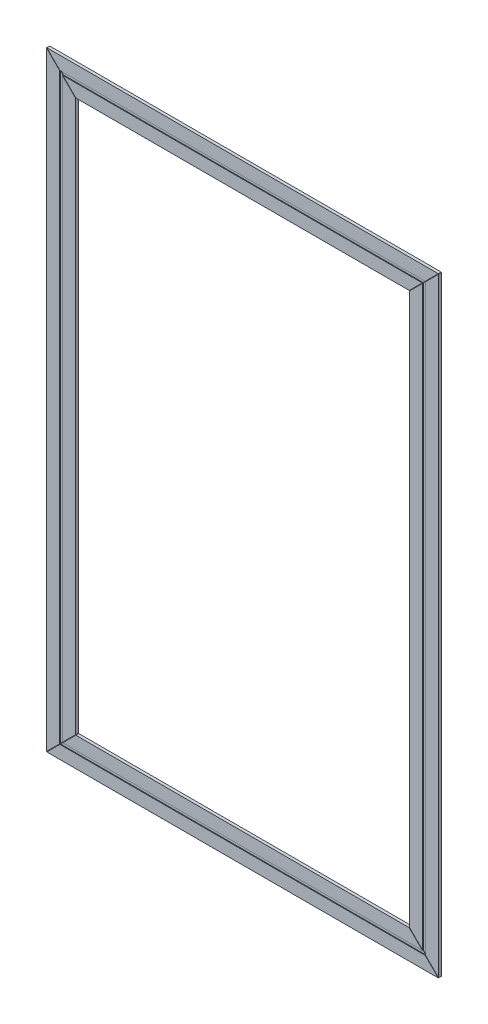
ISO-10303-21;
HEADER;
FILE_DESCRIPTION(('STEP AP214'),'2;1');
FILE_NAME('part.step','',(''),(''),'','','');
FILE_SCHEMA(('AUTOMOTIVE_DESIGN { 1 0 10303 214 1 1 1 1 }'));
ENDSEC;
DATA;
#1=APPLICATION_CONTEXT('core data for automotive mechanical design processes');
#2=APPLICATION_PROTOCOL_DEFINITION('international standard','automotive_design',2000,#1);
#3=PRODUCT_CONTEXT('',#1,'mechanical');
#4=PRODUCT('Part','Part','',(#3));
#5=PRODUCT_RELATED_PRODUCT_CATEGORY('part','',(#4));
#6=PRODUCT_DEFINITION_FORMATION('','',#4);
#7=PRODUCT_DEFINITION_CONTEXT('part definition',#1,'design');
#8=PRODUCT_DEFINITION('design','',#6,#7);
#9=PRODUCT_DEFINITION_SHAPE('','',#8);
#10=(LENGTH_UNIT() NAMED_UNIT(*) SI_UNIT(.MILLI.,.METRE.));
#11=(NAMED_UNIT(*) PLANE_ANGLE_UNIT() SI_UNIT($,.RADIAN.));
#12=(NAMED_UNIT(*) SI_UNIT($,.STERADIAN.) SOLID_ANGLE_UNIT());
#13=UNCERTAINTY_MEASURE_WITH_UNIT(LENGTH_MEASURE(1.E-05),#10,'distance_accuracy_value','');
#14=(GEOMETRIC_REPRESENTATION_CONTEXT(3) GLOBAL_UNCERTAINTY_ASSIGNED_CONTEXT((#13)) GLOBAL_UNIT_ASSIGNED_CONTEXT((#10,
#11,#12)) REPRESENTATION_CONTEXT('',''));
#15=CARTESIAN_POINT('',(0.,0.,0.));
#16=DIRECTION('',(0.,0.,1.));
#17=DIRECTION('',(1.,0.,0.));
#18=AXIS2_PLACEMENT_3D('',#15,#16,#17);
#19=CARTESIAN_POINT('',(0.,0.,2.));
#20=DIRECTION('',(0.,0.,1.));
#21=DIRECTION('',(1.,0.,0.));
#22=AXIS2_PLACEMENT_3D('',#19,#20,#21);
#23=PLANE('',#22);
#24=DIRECTION('',(0.70710678118655,0.707106781186545,0.));
#25=VECTOR('',#24,1.);
#26=CARTESIAN_POINT('',(-134.8,-210.,2.));
#27=LINE('',#26,#25);
#28=CARTESIAN_POINT('',(-134.8,-210.,2.));
#29=VERTEX_POINT('',#28);
#30=CARTESIAN_POINT('',(-125.8,-201.,2.));
#31=VERTEX_POINT('',#30);
#32=EDGE_CURVE('E124',#29,#31,#27,.T.);
#33=ORIENTED_EDGE('',*,*,#32,.F.);
#34=DIRECTION('',(1.,0.,0.));
#35=VECTOR('',#34,1.);
#36=CARTESIAN_POINT('',(0.,-210.,2.));
#37=LINE('',#36,#35);
#38=CARTESIAN_POINT('',(134.8,-210.,2.));
#39=VERTEX_POINT('',#38);
#40=EDGE_CURVE('E136',#29,#39,#37,.T.);
#41=ORIENTED_EDGE('',*,*,#40,.T.);
#42=DIRECTION('',(0.70710678118655,-0.707106781186545,0.));
#43=VECTOR('',#42,1.);
#44=CARTESIAN_POINT('',(134.8,-210.,2.));
#45=LINE('',#44,#43);
#46=CARTESIAN_POINT('',(125.8,-201.,2.));
#47=VERTEX_POINT('',#46);
#48=EDGE_CURVE('E130',#47,#39,#45,.T.);
#49=ORIENTED_EDGE('',*,*,#48,.F.);
#50=DIRECTION('',(-1.,0.,0.));
#51=VECTOR('',#50,1.);
#52=CARTESIAN_POINT('',(0.,-201.,2.));
#53=LINE('',#52,#51);
#54=EDGE_CURVE('E138',#47,#31,#53,.T.);
#55=ORIENTED_EDGE('',*,*,#54,.T.);
#56=EDGE_LOOP('',(#33,#41,#49,#55));
#57=FACE_BOUND('',#56,.T.);
#58=ADVANCED_FACE('F70',(#57),#23,.T.);
#59=CARTESIAN_POINT('',(0.,0.,0.));
#60=DIRECTION('',(0.,0.,1.));
#61=DIRECTION('',(1.,0.,0.));
#62=AXIS2_PLACEMENT_3D('',#59,#60,#61);
#63=PLANE('',#62);
#64=DIRECTION('',(1.,0.,0.));
#65=VECTOR('',#64,1.);
#66=CARTESIAN_POINT('',(0.,-210.,0.));
#67=LINE('',#66,#65);
#68=CARTESIAN_POINT('',(-134.8,-210.,0.));
#69=VERTEX_POINT('',#68);
#70=CARTESIAN_POINT('',(134.8,-210.,0.));
#71=VERTEX_POINT('',#70);
#72=EDGE_CURVE('E151',#69,#71,#67,.T.);
#73=ORIENTED_EDGE('',*,*,#72,.F.);
#74=DIRECTION('',(0.70710678118655,0.707106781186545,0.));
#75=VECTOR('',#74,1.);
#76=CARTESIAN_POINT('',(37.6000000000005,-37.6000000000008,0.));
#77=LINE('',#76,#75);
#78=CARTESIAN_POINT('',(-114.8,-190.,0.));
#79=VERTEX_POINT('',#78);
#80=EDGE_CURVE('E89',#69,#79,#77,.T.);
#81=ORIENTED_EDGE('',*,*,#80,.T.);
#82=DIRECTION('',(1.,0.,0.));
#83=VECTOR('',#82,1.);
#84=CARTESIAN_POINT('',(0.,-190.,0.));
#85=LINE('',#84,#83);
#86=CARTESIAN_POINT('',(114.8,-190.,0.));
#87=VERTEX_POINT('',#86);
#88=EDGE_CURVE('E157',#79,#87,#85,.T.);
#89=ORIENTED_EDGE('',*,*,#88,.T.);
#90=DIRECTION('',(0.70710678118655,-0.707106781186545,0.));
#91=VECTOR('',#90,1.);
#92=CARTESIAN_POINT('',(-37.6000000000005,-37.6000000000008,0.));
#93=LINE('',#92,#91);
#94=EDGE_CURVE('E152',#87,#71,#93,.T.);
#95=ORIENTED_EDGE('',*,*,#94,.T.);
#96=EDGE_LOOP('',(#73,#81,#89,#95));
#97=FACE_BOUND('',#96,.T.);
#98=ADVANCED_FACE('F72',(#97),#63,.F.);
#99=CARTESIAN_POINT('',(0.,0.,1.5));
#100=DIRECTION('',(0.,0.,1.));
#101=DIRECTION('',(1.,0.,0.));
#102=AXIS2_PLACEMENT_3D('',#99,#100,#101);
#103=PLANE('',#102);
#104=DIRECTION('',(0.70710678118655,0.707106781186545,0.));
#105=VECTOR('',#104,1.);
#106=CARTESIAN_POINT('',(37.6000000000005,-37.6000000000008,1.5));
#107=LINE('',#106,#105);
#108=CARTESIAN_POINT('',(-125.8,-201.,1.5));
#109=VERTEX_POINT('',#108);
#110=CARTESIAN_POINT('',(-123.8,-199.,1.5));
#111=VERTEX_POINT('',#110);
#112=EDGE_CURVE('E139',#109,#111,#107,.T.);
#113=ORIENTED_EDGE('',*,*,#112,.F.);
#114=DIRECTION('',(-1.,0.,0.));
#115=VECTOR('',#114,1.);
#116=CARTESIAN_POINT('',(0.,-201.,1.5));
#117=LINE('',#116,#115);
#118=CARTESIAN_POINT('',(125.8,-201.,1.5));
#119=VERTEX_POINT('',#118);
#120=EDGE_CURVE('E153',#119,#109,#117,.T.);
#121=ORIENTED_EDGE('',*,*,#120,.F.);
#122=DIRECTION('',(0.70710678118655,-0.707106781186545,0.));
#123=VECTOR('',#122,1.);
#124=CARTESIAN_POINT('',(-37.6000000000005,-37.6000000000008,1.5));
#125=LINE('',#124,#123);
#126=CARTESIAN_POINT('',(123.8,-199.,1.5));
#127=VERTEX_POINT('',#126);
#128=EDGE_CURVE('E179',#127,#119,#125,.T.);
#129=ORIENTED_EDGE('',*,*,#128,.F.);
#130=DIRECTION('',(-1.,0.,0.));
#131=VECTOR('',#130,1.);
#132=CARTESIAN_POINT('',(0.,-199.,1.5));
#133=LINE('',#132,#131);
#134=EDGE_CURVE('E148',#127,#111,#133,.T.);
#135=ORIENTED_EDGE('',*,*,#134,.T.);
#136=EDGE_LOOP('',(#113,#121,#129,#135));
#137=FACE_BOUND('',#136,.T.);
#138=ADVANCED_FACE('F210',(#137),#103,.T.);
#139=CARTESIAN_POINT('',(0.,0.,2.));
#140=DIRECTION('',(0.,0.,1.));
#141=DIRECTION('',(1.,0.,0.));
#142=AXIS2_PLACEMENT_3D('',#139,#140,#141);
#143=PLANE('',#142);
#144=DIRECTION('',(0.70710678118655,0.707106781186545,0.));
#145=VECTOR('',#144,1.);
#146=CARTESIAN_POINT('',(37.6000000000005,-37.6000000000008,2.));
#147=LINE('',#146,#145);
#148=CARTESIAN_POINT('',(-123.8,-199.,2.));
#149=VERTEX_POINT('',#148);
#150=CARTESIAN_POINT('',(-114.8,-190.,2.));
#151=VERTEX_POINT('',#150);
#152=EDGE_CURVE('E13',#149,#151,#147,.T.);
#153=ORIENTED_EDGE('',*,*,#152,.F.);
#154=DIRECTION('',(-1.,0.,0.));
#155=VECTOR('',#154,1.);
#156=CARTESIAN_POINT('',(0.,-199.,2.));
#157=LINE('',#156,#155);
#158=CARTESIAN_POINT('',(123.8,-199.,2.));
#159=VERTEX_POINT('',#158);
#160=EDGE_CURVE('E165',#159,#149,#157,.T.);
#161=ORIENTED_EDGE('',*,*,#160,.F.);
#162=CARTESIAN_POINT('',(114.8,-190.,2.));
#163=VERTEX_POINT('',#162);
#164=EDGE_CURVE('E74',#163,#159,#45,.T.);
#165=ORIENTED_EDGE('',*,*,#164,.F.);
#166=DIRECTION('',(1.,0.,0.));
#167=VECTOR('',#166,1.);
#168=CARTESIAN_POINT('',(0.,-190.,2.));
#169=LINE('',#168,#167);
#170=EDGE_CURVE('E160',#151,#163,#169,.T.);
#171=ORIENTED_EDGE('',*,*,#170,.F.);
#172=EDGE_LOOP('',(#153,#161,#165,#171));
#173=FACE_BOUND('',#172,.T.);
#174=ADVANCED_FACE('F199',(#173),#143,.T.);
#175=CARTESIAN_POINT('',(0.,-210.,2.));
#176=DIRECTION('',(0.,1.,0.));
#177=DIRECTION('',(0.,0.,1.));
#178=AXIS2_PLACEMENT_3D('',#175,#176,#177);
#179=PLANE('',#178);
#180=ORIENTED_EDGE('',*,*,#40,.F.);
#181=DIRECTION('',(0.,0.,1.));
#182=VECTOR('',#181,1.);
#183=CARTESIAN_POINT('',(-134.8,-210.,-19.));
#184=LINE('',#183,#182);
#185=EDGE_CURVE('E120',#69,#29,#184,.T.);
#186=ORIENTED_EDGE('',*,*,#185,.F.);
#187=ORIENTED_EDGE('',*,*,#72,.T.);
#188=DIRECTION('',(0.,0.,1.));
#189=VECTOR('',#188,1.);
#190=CARTESIAN_POINT('',(134.8,-210.,-19.));
#191=LINE('',#190,#189);
#192=EDGE_CURVE('E143',#71,#39,#191,.T.);
#193=ORIENTED_EDGE('',*,*,#192,.T.);
#194=EDGE_LOOP('',(#180,#186,#187,#193));
#195=FACE_BOUND('',#194,.T.);
#196=ADVANCED_FACE('F142',(#195),#179,.F.);
#197=CARTESIAN_POINT('',(0.,-201.,2.));
#198=DIRECTION('',(0.,-1.,0.));
#199=DIRECTION('',(0.,0.,-1.));
#200=AXIS2_PLACEMENT_3D('',#197,#198,#199);
#201=PLANE('',#200);
#202=ORIENTED_EDGE('',*,*,#120,.T.);
#203=DIRECTION('',(0.,0.,1.));
#204=VECTOR('',#203,1.);
#205=CARTESIAN_POINT('',(-125.8,-201.,2.));
#206=LINE('',#205,#204);
#207=EDGE_CURVE('E156',#109,#31,#206,.T.);
#208=ORIENTED_EDGE('',*,*,#207,.T.);
#209=ORIENTED_EDGE('',*,*,#54,.F.);
#210=DIRECTION('',(0.,0.,-1.));
#211=VECTOR('',#210,1.);
#212=CARTESIAN_POINT('',(125.8,-201.,2.));
#213=LINE('',#212,#211);
#214=EDGE_CURVE('E168',#47,#119,#213,.T.);
#215=ORIENTED_EDGE('',*,*,#214,.T.);
#216=EDGE_LOOP('',(#202,#208,#209,#215));
#217=FACE_BOUND('',#216,.T.);
#218=ADVANCED_FACE('F203',(#217),#201,.F.);
#219=CARTESIAN_POINT('',(0.,-199.,2.));
#220=DIRECTION('',(0.,-1.,0.));
#221=DIRECTION('',(0.,0.,-1.));
#222=AXIS2_PLACEMENT_3D('',#219,#220,#221);
#223=PLANE('',#222);
#224=DIRECTION('',(0.,0.,1.));
#225=VECTOR('',#224,1.);
#226=CARTESIAN_POINT('',(-123.8,-199.,2.));
#227=LINE('',#226,#225);
#228=EDGE_CURVE('E80',#111,#149,#227,.T.);
#229=ORIENTED_EDGE('',*,*,#228,.F.);
#230=ORIENTED_EDGE('',*,*,#134,.F.);
#231=DIRECTION('',(0.,0.,-1.));
#232=VECTOR('',#231,1.);
#233=CARTESIAN_POINT('',(123.8,-199.,2.));
#234=LINE('',#233,#232);
#235=EDGE_CURVE('E181',#159,#127,#234,.T.);
#236=ORIENTED_EDGE('',*,*,#235,.F.);
#237=ORIENTED_EDGE('',*,*,#160,.T.);
#238=EDGE_LOOP('',(#229,#230,#236,#237));
#239=FACE_BOUND('',#238,.T.);
#240=ADVANCED_FACE('F214',(#239),#223,.T.);
#241=CARTESIAN_POINT('',(0.,-190.,2.));
#242=DIRECTION('',(0.,1.,0.));
#243=DIRECTION('',(0.,0.,1.));
#244=AXIS2_PLACEMENT_3D('',#241,#242,#243);
#245=PLANE('',#244);
#246=DIRECTION('',(0.,0.,1.));
#247=VECTOR('',#246,1.);
#248=CARTESIAN_POINT('',(-114.8,-190.,-19.));
#249=LINE('',#248,#247);
#250=EDGE_CURVE('E164',#79,#151,#249,.T.);
#251=ORIENTED_EDGE('',*,*,#250,.T.);
#252=ORIENTED_EDGE('',*,*,#170,.T.);
#253=DIRECTION('',(0.,0.,1.));
#254=VECTOR('',#253,1.);
#255=CARTESIAN_POINT('',(114.8,-190.,-19.));
#256=LINE('',#255,#254);
#257=EDGE_CURVE('E163',#87,#163,#256,.T.);
#258=ORIENTED_EDGE('',*,*,#257,.F.);
#259=ORIENTED_EDGE('',*,*,#88,.F.);
#260=EDGE_LOOP('',(#251,#252,#258,#259));
#261=FACE_BOUND('',#260,.T.);
#262=ADVANCED_FACE('F194',(#261),#245,.T.);
#263=CARTESIAN_POINT('',(134.8,-210.,-19.));
#264=DIRECTION('',(-0.707106781186545,-0.70710678118655,0.));
#265=DIRECTION('',(0.70710678118655,-0.707106781186545,0.));
#266=AXIS2_PLACEMENT_3D('',#263,#264,#265);
#267=PLANE('',#266);
#268=ORIENTED_EDGE('',*,*,#257,.T.);
#269=ORIENTED_EDGE('',*,*,#164,.T.);
#270=ORIENTED_EDGE('',*,*,#235,.T.);
#271=ORIENTED_EDGE('',*,*,#128,.T.);
#272=ORIENTED_EDGE('',*,*,#214,.F.);
#273=ORIENTED_EDGE('',*,*,#48,.T.);
#274=ORIENTED_EDGE('',*,*,#192,.F.);
#275=ORIENTED_EDGE('',*,*,#94,.F.);
#276=EDGE_LOOP('',(#268,#269,#270,#271,#272,#273,#274,#275));
#277=FACE_BOUND('',#276,.T.);
#278=ADVANCED_FACE('F190',(#277),#267,.F.);
#279=CARTESIAN_POINT('',(-134.8,-210.,-19.));
#280=DIRECTION('',(0.707106781186545,-0.70710678118655,0.));
#281=DIRECTION('',(0.70710678118655,0.707106781186545,0.));
#282=AXIS2_PLACEMENT_3D('',#279,#280,#281);
#283=PLANE('',#282);
#284=ORIENTED_EDGE('',*,*,#185,.T.);
#285=ORIENTED_EDGE('',*,*,#32,.T.);
#286=ORIENTED_EDGE('',*,*,#207,.F.);
#287=ORIENTED_EDGE('',*,*,#112,.T.);
#288=ORIENTED_EDGE('',*,*,#228,.T.);
#289=ORIENTED_EDGE('',*,*,#152,.T.);
#290=ORIENTED_EDGE('',*,*,#250,.F.);
#291=ORIENTED_EDGE('',*,*,#80,.F.);
#292=EDGE_LOOP('',(#284,#285,#286,#287,#288,#289,#290,#291));
#293=FACE_BOUND('',#292,.T.);
#294=ADVANCED_FACE('F122',(#293),#283,.F.);
#295=CLOSED_SHELL('',(#58,#98,#138,#174,#196,#218,#240,#262,#278,#294));
#296=MANIFOLD_SOLID_BREP('B2',#295);
#297=CARTESIAN_POINT('',(0.,0.,2.));
#298=DIRECTION('',(0.,0.,1.));
#299=DIRECTION('',(1.,0.,0.));
#300=AXIS2_PLACEMENT_3D('',#297,#298,#299);
#301=PLANE('',#300);
#302=DIRECTION('',(-0.70710678118655,-0.707106781186545,0.));
#303=VECTOR('',#302,1.);
#304=CARTESIAN_POINT('',(134.8,210.,2.));
#305=LINE('',#304,#303);
#306=CARTESIAN_POINT('',(134.8,210.,2.));
#307=VERTEX_POINT('',#306);
#308=CARTESIAN_POINT('',(125.8,201.,2.));
#309=VERTEX_POINT('',#308);
#310=EDGE_CURVE('E394',#307,#309,#305,.T.);
#311=ORIENTED_EDGE('',*,*,#310,.F.);
#312=DIRECTION('',(1.,0.,0.));
#313=VECTOR('',#312,1.);
#314=CARTESIAN_POINT('',(0.,210.,2.));
#315=LINE('',#314,#313);
#316=CARTESIAN_POINT('',(-134.8,210.,2.));
#317=VERTEX_POINT('',#316);
#318=EDGE_CURVE('E511',#317,#307,#315,.T.);
#319=ORIENTED_EDGE('',*,*,#318,.F.);
#320=DIRECTION('',(-0.70710678118655,0.707106781186545,0.));
#321=VECTOR('',#320,1.);
#322=CARTESIAN_POINT('',(-134.8,210.,2.));
#323=LINE('',#322,#321);
#324=CARTESIAN_POINT('',(-125.8,201.,2.));
#325=VERTEX_POINT('',#324);
#326=EDGE_CURVE('E499',#325,#317,#323,.T.);
#327=ORIENTED_EDGE('',*,*,#326,.F.);
#328=DIRECTION('',(-1.,0.,0.));
#329=VECTOR('',#328,1.);
#330=CARTESIAN_POINT('',(0.,201.,2.));
#331=LINE('',#330,#329);
#332=EDGE_CURVE('E508',#309,#325,#331,.T.);
#333=ORIENTED_EDGE('',*,*,#332,.F.);
#334=EDGE_LOOP('',(#311,#319,#327,#333));
#335=FACE_BOUND('',#334,.T.);
#336=ADVANCED_FACE('F391',(#335),#301,.T.);
#337=CARTESIAN_POINT('',(0.,0.,2.));
#338=DIRECTION('',(0.,0.,1.));
#339=DIRECTION('',(1.,0.,0.));
#340=AXIS2_PLACEMENT_3D('',#337,#338,#339);
#341=PLANE('',#340);
#342=DIRECTION('',(-0.70710678118655,-0.707106781186545,0.));
#343=VECTOR('',#342,1.);
#344=CARTESIAN_POINT('',(-37.6000000000004,37.6000000000007,2.));
#345=LINE('',#344,#343);
#346=CARTESIAN_POINT('',(123.8,199.,2.));
#347=VERTEX_POINT('',#346);
#348=CARTESIAN_POINT('',(114.8,190.,2.));
#349=VERTEX_POINT('',#348);
#350=EDGE_CURVE('E68',#347,#349,#345,.T.);
#351=ORIENTED_EDGE('',*,*,#350,.F.);
#352=DIRECTION('',(-1.,0.,0.));
#353=VECTOR('',#352,1.);
#354=CARTESIAN_POINT('',(0.,199.,2.));
#355=LINE('',#354,#353);
#356=CARTESIAN_POINT('',(-123.8,199.,2.));
#357=VERTEX_POINT('',#356);
#358=EDGE_CURVE('E489',#347,#357,#355,.T.);
#359=ORIENTED_EDGE('',*,*,#358,.T.);
#360=CARTESIAN_POINT('',(-114.8,190.,2.));
#361=VERTEX_POINT('',#360);
#362=EDGE_CURVE('E502',#361,#357,#323,.T.);
#363=ORIENTED_EDGE('',*,*,#362,.F.);
#364=DIRECTION('',(1.,0.,0.));
#365=VECTOR('',#364,1.);
#366=CARTESIAN_POINT('',(0.,190.,2.));
#367=LINE('',#366,#365);
#368=EDGE_CURVE('E486',#361,#349,#367,.T.);
#369=ORIENTED_EDGE('',*,*,#368,.T.);
#370=EDGE_LOOP('',(#351,#359,#363,#369));
#371=FACE_BOUND('',#370,.T.);
#372=ADVANCED_FACE('F525',(#371),#341,.T.);
#373=CARTESIAN_POINT('',(0.,199.,2.));
#374=DIRECTION('',(0.,-1.,0.));
#375=DIRECTION('',(0.,0.,-1.));
#376=AXIS2_PLACEMENT_3D('',#373,#374,#375);
#377=PLANE('',#376);
#378=ORIENTED_EDGE('',*,*,#358,.F.);
#379=DIRECTION('',(0.,0.,-1.));
#380=VECTOR('',#379,1.);
#381=CARTESIAN_POINT('',(123.8,199.,2.));
#382=LINE('',#381,#380);
#383=CARTESIAN_POINT('',(123.8,199.,1.5));
#384=VERTEX_POINT('',#383);
#385=EDGE_CURVE('E448',#347,#384,#382,.T.);
#386=ORIENTED_EDGE('',*,*,#385,.T.);
#387=DIRECTION('',(-1.,0.,0.));
#388=VECTOR('',#387,1.);
#389=CARTESIAN_POINT('',(0.,199.,1.5));
#390=LINE('',#389,#388);
#391=CARTESIAN_POINT('',(-123.8,199.,1.5));
#392=VERTEX_POINT('',#391);
#393=EDGE_CURVE('E469',#384,#392,#390,.T.);
#394=ORIENTED_EDGE('',*,*,#393,.T.);
#395=DIRECTION('',(0.,0.,1.));
#396=VECTOR('',#395,1.);
#397=CARTESIAN_POINT('',(-123.8,199.,2.));
#398=LINE('',#397,#396);
#399=EDGE_CURVE('E485',#392,#357,#398,.T.);
#400=ORIENTED_EDGE('',*,*,#399,.T.);
#401=EDGE_LOOP('',(#378,#386,#394,#400));
#402=FACE_BOUND('',#401,.T.);
#403=ADVANCED_FACE('F529',(#402),#377,.F.);
#404=CARTESIAN_POINT('',(0.,190.,2.));
#405=DIRECTION('',(0.,1.,0.));
#406=DIRECTION('',(0.,0.,1.));
#407=AXIS2_PLACEMENT_3D('',#404,#405,#406);
#408=PLANE('',#407);
#409=DIRECTION('',(1.,0.,0.));
#410=VECTOR('',#409,1.);
#411=CARTESIAN_POINT('',(0.,190.,0.));
#412=LINE('',#411,#410);
#413=CARTESIAN_POINT('',(-114.8,190.,0.));
#414=VERTEX_POINT('',#413);
#415=CARTESIAN_POINT('',(114.8,190.,0.));
#416=VERTEX_POINT('',#415);
#417=EDGE_CURVE('E479',#414,#416,#412,.T.);
#418=ORIENTED_EDGE('',*,*,#417,.T.);
#419=DIRECTION('',(0.,0.,1.));
#420=VECTOR('',#419,1.);
#421=CARTESIAN_POINT('',(114.8,190.,-19.));
#422=LINE('',#421,#420);
#423=EDGE_CURVE('E475',#416,#349,#422,.T.);
#424=ORIENTED_EDGE('',*,*,#423,.T.);
#425=ORIENTED_EDGE('',*,*,#368,.F.);
#426=DIRECTION('',(0.,0.,1.));
#427=VECTOR('',#426,1.);
#428=CARTESIAN_POINT('',(-114.8,190.,-19.));
#429=LINE('',#428,#427);
#430=EDGE_CURVE('E505',#414,#361,#429,.T.);
#431=ORIENTED_EDGE('',*,*,#430,.F.);
#432=EDGE_LOOP('',(#418,#424,#425,#431));
#433=FACE_BOUND('',#432,.T.);
#434=ADVANCED_FACE('F535',(#433),#408,.F.);
#435=CARTESIAN_POINT('',(0.,0.,1.5));
#436=DIRECTION('',(0.,0.,1.));
#437=DIRECTION('',(1.,0.,0.));
#438=AXIS2_PLACEMENT_3D('',#435,#436,#437);
#439=PLANE('',#438);
#440=DIRECTION('',(-0.70710678118655,-0.707106781186545,0.));
#441=VECTOR('',#440,1.);
#442=CARTESIAN_POINT('',(-37.6000000000004,37.6000000000007,1.5));
#443=LINE('',#442,#441);
#444=CARTESIAN_POINT('',(125.8,201.,1.5));
#445=VERTEX_POINT('',#444);
#446=EDGE_CURVE('E400',#445,#384,#443,.T.);
#447=ORIENTED_EDGE('',*,*,#446,.F.);
#448=DIRECTION('',(-1.,0.,0.));
#449=VECTOR('',#448,1.);
#450=CARTESIAN_POINT('',(0.,201.,1.5));
#451=LINE('',#450,#449);
#452=CARTESIAN_POINT('',(-125.8,201.,1.5));
#453=VERTEX_POINT('',#452);
#454=EDGE_CURVE('E467',#445,#453,#451,.T.);
#455=ORIENTED_EDGE('',*,*,#454,.T.);
#456=DIRECTION('',(-0.70710678118655,0.707106781186545,0.));
#457=VECTOR('',#456,1.);
#458=CARTESIAN_POINT('',(37.6000000000004,37.6000000000007,1.5));
#459=LINE('',#458,#457);
#460=EDGE_CURVE('E500',#392,#453,#459,.T.);
#461=ORIENTED_EDGE('',*,*,#460,.F.);
#462=ORIENTED_EDGE('',*,*,#393,.F.);
#463=EDGE_LOOP('',(#447,#455,#461,#462));
#464=FACE_BOUND('',#463,.T.);
#465=ADVANCED_FACE('F465',(#464),#439,.T.);
#466=CARTESIAN_POINT('',(0.,0.,0.));
#467=DIRECTION('',(0.,0.,1.));
#468=DIRECTION('',(1.,0.,0.));
#469=AXIS2_PLACEMENT_3D('',#466,#467,#468);
#470=PLANE('',#469);
#471=DIRECTION('',(1.,0.,0.));
#472=VECTOR('',#471,1.);
#473=CARTESIAN_POINT('',(0.,210.,0.));
#474=LINE('',#473,#472);
#475=CARTESIAN_POINT('',(-134.8,210.,0.));
#476=VERTEX_POINT('',#475);
#477=CARTESIAN_POINT('',(134.8,210.,0.));
#478=VERTEX_POINT('',#477);
#479=EDGE_CURVE('E474',#476,#478,#474,.T.);
#480=ORIENTED_EDGE('',*,*,#479,.T.);
#481=DIRECTION('',(-0.70710678118655,-0.707106781186545,0.));
#482=VECTOR('',#481,1.);
#483=CARTESIAN_POINT('',(-37.6000000000004,37.6000000000007,0.));
#484=LINE('',#483,#482);
#485=EDGE_CURVE('E409',#478,#416,#484,.T.);
#486=ORIENTED_EDGE('',*,*,#485,.T.);
#487=ORIENTED_EDGE('',*,*,#417,.F.);
#488=DIRECTION('',(-0.70710678118655,0.707106781186545,0.));
#489=VECTOR('',#488,1.);
#490=CARTESIAN_POINT('',(37.6000000000004,37.6000000000007,0.));
#491=LINE('',#490,#489);
#492=EDGE_CURVE('E492',#414,#476,#491,.T.);
#493=ORIENTED_EDGE('',*,*,#492,.T.);
#494=EDGE_LOOP('',(#480,#486,#487,#493));
#495=FACE_BOUND('',#494,.T.);
#496=ADVANCED_FACE('F542',(#495),#470,.F.);
#497=CARTESIAN_POINT('',(0.,210.,2.));
#498=DIRECTION('',(0.,1.,0.));
#499=DIRECTION('',(0.,0.,1.));
#500=AXIS2_PLACEMENT_3D('',#497,#498,#499);
#501=PLANE('',#500);
#502=DIRECTION('',(0.,0.,1.));
#503=VECTOR('',#502,1.);
#504=CARTESIAN_POINT('',(134.8,210.,-19.));
#505=LINE('',#504,#503);
#506=EDGE_CURVE('E513',#478,#307,#505,.T.);
#507=ORIENTED_EDGE('',*,*,#506,.F.);
#508=ORIENTED_EDGE('',*,*,#479,.F.);
#509=DIRECTION('',(0.,0.,1.));
#510=VECTOR('',#509,1.);
#511=CARTESIAN_POINT('',(-134.8,210.,-19.));
#512=LINE('',#511,#510);
#513=EDGE_CURVE('E497',#476,#317,#512,.T.);
#514=ORIENTED_EDGE('',*,*,#513,.T.);
#515=ORIENTED_EDGE('',*,*,#318,.T.);
#516=EDGE_LOOP('',(#507,#508,#514,#515));
#517=FACE_BOUND('',#516,.T.);
#518=ADVANCED_FACE('F522',(#517),#501,.T.);
#519=CARTESIAN_POINT('',(0.,201.,2.));
#520=DIRECTION('',(0.,-1.,0.));
#521=DIRECTION('',(0.,0.,-1.));
#522=AXIS2_PLACEMENT_3D('',#519,#520,#521);
#523=PLANE('',#522);
#524=DIRECTION('',(0.,0.,-1.));
#525=VECTOR('',#524,1.);
#526=CARTESIAN_POINT('',(125.8,201.,2.));
#527=LINE('',#526,#525);
#528=EDGE_CURVE('E453',#309,#445,#527,.T.);
#529=ORIENTED_EDGE('',*,*,#528,.F.);
#530=ORIENTED_EDGE('',*,*,#332,.T.);
#531=DIRECTION('',(0.,0.,1.));
#532=VECTOR('',#531,1.);
#533=CARTESIAN_POINT('',(-125.8,201.,2.));
#534=LINE('',#533,#532);
#535=EDGE_CURVE('E473',#453,#325,#534,.T.);
#536=ORIENTED_EDGE('',*,*,#535,.F.);
#537=ORIENTED_EDGE('',*,*,#454,.F.);
#538=EDGE_LOOP('',(#529,#530,#536,#537));
#539=FACE_BOUND('',#538,.T.);
#540=ADVANCED_FACE('F472',(#539),#523,.T.);
#541=CARTESIAN_POINT('',(-134.8,210.,-19.));
#542=DIRECTION('',(0.707106781186545,0.70710678118655,0.));
#543=DIRECTION('',(-0.70710678118655,0.707106781186545,0.));
#544=AXIS2_PLACEMENT_3D('',#541,#542,#543);
#545=PLANE('',#544);
#546=ORIENTED_EDGE('',*,*,#430,.T.);
#547=ORIENTED_EDGE('',*,*,#362,.T.);
#548=ORIENTED_EDGE('',*,*,#399,.F.);
#549=ORIENTED_EDGE('',*,*,#460,.T.);
#550=ORIENTED_EDGE('',*,*,#535,.T.);
#551=ORIENTED_EDGE('',*,*,#326,.T.);
#552=ORIENTED_EDGE('',*,*,#513,.F.);
#553=ORIENTED_EDGE('',*,*,#492,.F.);
#554=EDGE_LOOP('',(#546,#547,#548,#549,#550,#551,#552,#553));
#555=FACE_BOUND('',#554,.T.);
#556=ADVANCED_FACE('F516',(#555),#545,.F.);
#557=CARTESIAN_POINT('',(134.8,210.,-19.));
#558=DIRECTION('',(-0.707106781186545,0.70710678118655,0.));
#559=DIRECTION('',(-0.70710678118655,-0.707106781186545,0.));
#560=AXIS2_PLACEMENT_3D('',#557,#558,#559);
#561=PLANE('',#560);
#562=ORIENTED_EDGE('',*,*,#506,.T.);
#563=ORIENTED_EDGE('',*,*,#310,.T.);
#564=ORIENTED_EDGE('',*,*,#528,.T.);
#565=ORIENTED_EDGE('',*,*,#446,.T.);
#566=ORIENTED_EDGE('',*,*,#385,.F.);
#567=ORIENTED_EDGE('',*,*,#350,.T.);
#568=ORIENTED_EDGE('',*,*,#423,.F.);
#569=ORIENTED_EDGE('',*,*,#485,.F.);
#570=EDGE_LOOP('',(#562,#563,#564,#565,#566,#567,#568,#569));
#571=FACE_BOUND('',#570,.T.);
#572=ADVANCED_FACE('F455',(#571),#561,.F.);
#573=CLOSED_SHELL('',(#336,#372,#403,#434,#465,#496,#518,#540,#556,#572));
#574=MANIFOLD_SOLID_BREP('B7',#573);
#575=CARTESIAN_POINT('',(0.,0.,2.));
#576=DIRECTION('',(0.,0.,1.));
#577=DIRECTION('',(1.,0.,0.));
#578=AXIS2_PLACEMENT_3D('',#575,#576,#577);
#579=PLANE('',#578);
#580=DIRECTION('',(-0.707106781186549,-0.707106781186546,0.));
#581=VECTOR('',#580,1.);
#582=CARTESIAN_POINT('',(-115.,-189.8,2.));
#583=LINE('',#582,#581);
#584=CARTESIAN_POINT('',(-115.,-189.8,2.));
#585=VERTEX_POINT('',#584);
#586=CARTESIAN_POINT('',(-124.,-198.8,2.));
#587=VERTEX_POINT('',#586);
#588=EDGE_CURVE('E715',#585,#587,#583,.T.);
#589=ORIENTED_EDGE('',*,*,#588,.F.);
#590=DIRECTION('',(0.,1.,0.));
#591=VECTOR('',#590,1.);
#592=CARTESIAN_POINT('',(-115.,0.,2.));
#593=LINE('',#592,#591);
#594=CARTESIAN_POINT('',(-115.,189.8,2.));
#595=VERTEX_POINT('',#594);
#596=EDGE_CURVE('E800',#585,#595,#593,.T.);
#597=ORIENTED_EDGE('',*,*,#596,.T.);
#598=DIRECTION('',(0.70710678118655,-0.707106781186545,0.));
#599=VECTOR('',#598,1.);
#600=CARTESIAN_POINT('',(37.4000000000004,37.4000000000007,2.));
#601=LINE('',#600,#599);
#602=CARTESIAN_POINT('',(-124.,198.8,2.));
#603=VERTEX_POINT('',#602);
#604=EDGE_CURVE('E818',#603,#595,#601,.T.);
#605=ORIENTED_EDGE('',*,*,#604,.F.);
#606=DIRECTION('',(0.,-1.,0.));
#607=VECTOR('',#606,1.);
#608=CARTESIAN_POINT('',(-124.,0.,2.));
#609=LINE('',#608,#607);
#610=EDGE_CURVE('E791',#603,#587,#609,.T.);
#611=ORIENTED_EDGE('',*,*,#610,.T.);
#612=EDGE_LOOP('',(#589,#597,#605,#611));
#613=FACE_BOUND('',#612,.T.);
#614=ADVANCED_FACE('F711',(#613),#579,.T.);
#615=CARTESIAN_POINT('',(-124.,0.,2.));
#616=DIRECTION('',(1.,0.,0.));
#617=DIRECTION('',(0.,0.,-1.));
#618=AXIS2_PLACEMENT_3D('',#615,#616,#617);
#619=PLANE('',#618);
#620=DIRECTION('',(0.,-1.,0.));
#621=VECTOR('',#620,1.);
#622=CARTESIAN_POINT('',(-124.,0.,1.5));
#623=LINE('',#622,#621);
#624=CARTESIAN_POINT('',(-124.,198.8,1.5));
#625=VERTEX_POINT('',#624);
#626=CARTESIAN_POINT('',(-124.,-198.8,1.5));
#627=VERTEX_POINT('',#626);
#628=EDGE_CURVE('E787',#625,#627,#623,.T.);
#629=ORIENTED_EDGE('',*,*,#628,.T.);
#630=DIRECTION('',(0.,0.,1.));
#631=VECTOR('',#630,1.);
#632=CARTESIAN_POINT('',(-124.,-198.8,2.));
#633=LINE('',#632,#631);
#634=EDGE_CURVE('E790',#627,#587,#633,.T.);
#635=ORIENTED_EDGE('',*,*,#634,.T.);
#636=ORIENTED_EDGE('',*,*,#610,.F.);
#637=DIRECTION('',(0.,0.,-1.));
#638=VECTOR('',#637,1.);
#639=CARTESIAN_POINT('',(-124.,198.8,2.));
#640=LINE('',#639,#638);
#641=EDGE_CURVE('E799',#603,#625,#640,.T.);
#642=ORIENTED_EDGE('',*,*,#641,.T.);
#643=EDGE_LOOP('',(#629,#635,#636,#642));
#644=FACE_BOUND('',#643,.T.);
#645=ADVANCED_FACE('F843',(#644),#619,.F.);
#646=CARTESIAN_POINT('',(-115.,0.,2.));
#647=DIRECTION('',(-1.,0.,0.));
#648=DIRECTION('',(0.,0.,1.));
#649=AXIS2_PLACEMENT_3D('',#646,#647,#648);
#650=PLANE('',#649);
#651=ORIENTED_EDGE('',*,*,#596,.F.);
#652=DIRECTION('',(0.,0.,1.));
#653=VECTOR('',#652,1.);
#654=CARTESIAN_POINT('',(-115.,-189.8,-19.));
#655=LINE('',#654,#653);
#656=CARTESIAN_POINT('',(-115.,-189.8,0.));
#657=VERTEX_POINT('',#656);
#658=EDGE_CURVE('E823',#657,#585,#655,.T.);
#659=ORIENTED_EDGE('',*,*,#658,.F.);
#660=DIRECTION('',(0.,1.,0.));
#661=VECTOR('',#660,1.);
#662=CARTESIAN_POINT('',(-115.,0.,0.));
#663=LINE('',#662,#661);
#664=CARTESIAN_POINT('',(-115.,189.8,0.));
#665=VERTEX_POINT('',#664);
#666=EDGE_CURVE('E796',#657,#665,#663,.T.);
#667=ORIENTED_EDGE('',*,*,#666,.T.);
#668=DIRECTION('',(0.,0.,1.));
#669=VECTOR('',#668,1.);
#670=CARTESIAN_POINT('',(-115.,189.8,-19.));
#671=LINE('',#670,#669);
#672=EDGE_CURVE('E795',#665,#595,#671,.T.);
#673=ORIENTED_EDGE('',*,*,#672,.T.);
#674=EDGE_LOOP('',(#651,#659,#667,#673));
#675=FACE_BOUND('',#674,.T.);
#676=ADVANCED_FACE('F834',(#675),#650,.F.);
#677=CARTESIAN_POINT('',(0.,0.,1.5));
#678=DIRECTION('',(0.,0.,1.));
#679=DIRECTION('',(1.,0.,0.));
#680=AXIS2_PLACEMENT_3D('',#677,#678,#679);
#681=PLANE('',#680);
#682=DIRECTION('',(-0.70710678118655,-0.707106781186546,0.));
#683=VECTOR('',#682,1.);
#684=CARTESIAN_POINT('',(37.4000000000004,-37.4000000000006,1.5));
#685=LINE('',#684,#683);
#686=CARTESIAN_POINT('',(-126.,-200.8,1.5));
#687=VERTEX_POINT('',#686);
#688=EDGE_CURVE('E809',#627,#687,#685,.T.);
#689=ORIENTED_EDGE('',*,*,#688,.F.);
#690=ORIENTED_EDGE('',*,*,#628,.F.);
#691=DIRECTION('',(0.70710678118655,-0.707106781186545,0.));
#692=VECTOR('',#691,1.);
#693=CARTESIAN_POINT('',(37.4000000000004,37.4000000000007,1.5));
#694=LINE('',#693,#692);
#695=CARTESIAN_POINT('',(-126.,200.8,1.5));
#696=VERTEX_POINT('',#695);
#697=EDGE_CURVE('E816',#696,#625,#694,.T.);
#698=ORIENTED_EDGE('',*,*,#697,.F.);
#699=DIRECTION('',(0.,-1.,0.));
#700=VECTOR('',#699,1.);
#701=CARTESIAN_POINT('',(-126.,0.,1.5));
#702=LINE('',#701,#700);
#703=EDGE_CURVE('E792',#696,#687,#702,.T.);
#704=ORIENTED_EDGE('',*,*,#703,.T.);
#705=EDGE_LOOP('',(#689,#690,#698,#704));
#706=FACE_BOUND('',#705,.T.);
#707=ADVANCED_FACE('F849',(#706),#681,.T.);
#708=CARTESIAN_POINT('',(0.,0.,0.));
#709=DIRECTION('',(0.,0.,1.));
#710=DIRECTION('',(1.,0.,0.));
#711=AXIS2_PLACEMENT_3D('',#708,#709,#710);
#712=PLANE('',#711);
#713=ORIENTED_EDGE('',*,*,#666,.F.);
#714=DIRECTION('',(-0.70710678118655,-0.707106781186546,0.));
#715=VECTOR('',#714,1.);
#716=CARTESIAN_POINT('',(37.4000000000004,-37.4000000000006,0.));
#717=LINE('',#716,#715);
#718=CARTESIAN_POINT('',(-135.,-209.8,0.));
#719=VERTEX_POINT('',#718);
#720=EDGE_CURVE('E729',#657,#719,#717,.T.);
#721=ORIENTED_EDGE('',*,*,#720,.T.);
#722=DIRECTION('',(0.,1.,0.));
#723=VECTOR('',#722,1.);
#724=CARTESIAN_POINT('',(-135.,0.,0.));
#725=LINE('',#724,#723);
#726=CARTESIAN_POINT('',(-135.,209.8,0.));
#727=VERTEX_POINT('',#726);
#728=EDGE_CURVE('E806',#719,#727,#725,.T.);
#729=ORIENTED_EDGE('',*,*,#728,.T.);
#730=DIRECTION('',(0.70710678118655,-0.707106781186545,0.));
#731=VECTOR('',#730,1.);
#732=CARTESIAN_POINT('',(37.4000000000004,37.4000000000007,0.));
#733=LINE('',#732,#731);
#734=EDGE_CURVE('E765',#727,#665,#733,.T.);
#735=ORIENTED_EDGE('',*,*,#734,.T.);
#736=EDGE_LOOP('',(#713,#721,#729,#735));
#737=FACE_BOUND('',#736,.T.);
#738=ADVANCED_FACE('F831',(#737),#712,.F.);
#739=CARTESIAN_POINT('',(0.,0.,2.));
#740=DIRECTION('',(0.,0.,1.));
#741=DIRECTION('',(1.,0.,0.));
#742=AXIS2_PLACEMENT_3D('',#739,#740,#741);
#743=PLANE('',#742);
#744=CARTESIAN_POINT('',(-126.,-200.8,2.));
#745=VERTEX_POINT('',#744);
#746=CARTESIAN_POINT('',(-135.,-209.8,2.));
#747=VERTEX_POINT('',#746);
#748=EDGE_CURVE('E389',#745,#747,#583,.T.);
#749=ORIENTED_EDGE('',*,*,#748,.F.);
#750=DIRECTION('',(0.,-1.,0.));
#751=VECTOR('',#750,1.);
#752=CARTESIAN_POINT('',(-126.,0.,2.));
#753=LINE('',#752,#751);
#754=CARTESIAN_POINT('',(-126.,200.8,2.));
#755=VERTEX_POINT('',#754);
#756=EDGE_CURVE('E770',#755,#745,#753,.T.);
#757=ORIENTED_EDGE('',*,*,#756,.F.);
#758=DIRECTION('',(0.70710678118655,-0.707106781186545,0.));
#759=VECTOR('',#758,1.);
#760=CARTESIAN_POINT('',(-115.,189.8,2.));
#761=LINE('',#760,#759);
#762=CARTESIAN_POINT('',(-135.,209.8,2.));
#763=VERTEX_POINT('',#762);
#764=EDGE_CURVE('E762',#763,#755,#761,.T.);
#765=ORIENTED_EDGE('',*,*,#764,.F.);
#766=DIRECTION('',(0.,1.,0.));
#767=VECTOR('',#766,1.);
#768=CARTESIAN_POINT('',(-135.,0.,2.));
#769=LINE('',#768,#767);
#770=EDGE_CURVE('E776',#747,#763,#769,.T.);
#771=ORIENTED_EDGE('',*,*,#770,.F.);
#772=EDGE_LOOP('',(#749,#757,#765,#771));
#773=FACE_BOUND('',#772,.T.);
#774=ADVANCED_FACE('F713',(#773),#743,.T.);
#775=CARTESIAN_POINT('',(-135.,0.,2.));
#776=DIRECTION('',(-1.,0.,0.));
#777=DIRECTION('',(0.,0.,1.));
#778=AXIS2_PLACEMENT_3D('',#775,#776,#777);
#779=PLANE('',#778);
#780=DIRECTION('',(0.,0.,1.));
#781=VECTOR('',#780,1.);
#782=CARTESIAN_POINT('',(-135.,-209.8,-19.));
#783=LINE('',#782,#781);
#784=EDGE_CURVE('E782',#719,#747,#783,.T.);
#785=ORIENTED_EDGE('',*,*,#784,.T.);
#786=ORIENTED_EDGE('',*,*,#770,.T.);
#787=DIRECTION('',(0.,0.,1.));
#788=VECTOR('',#787,1.);
#789=CARTESIAN_POINT('',(-135.,209.8,-19.));
#790=LINE('',#789,#788);
#791=EDGE_CURVE('E759',#727,#763,#790,.T.);
#792=ORIENTED_EDGE('',*,*,#791,.F.);
#793=ORIENTED_EDGE('',*,*,#728,.F.);
#794=EDGE_LOOP('',(#785,#786,#792,#793));
#795=FACE_BOUND('',#794,.T.);
#796=ADVANCED_FACE('F781',(#795),#779,.T.);
#797=CARTESIAN_POINT('',(-126.,0.,2.));
#798=DIRECTION('',(1.,0.,0.));
#799=DIRECTION('',(0.,0.,-1.));
#800=AXIS2_PLACEMENT_3D('',#797,#798,#799);
#801=PLANE('',#800);
#802=DIRECTION('',(0.,0.,1.));
#803=VECTOR('',#802,1.);
#804=CARTESIAN_POINT('',(-126.,-200.8,2.));
#805=LINE('',#804,#803);
#806=EDGE_CURVE('E721',#687,#745,#805,.T.);
#807=ORIENTED_EDGE('',*,*,#806,.F.);
#808=ORIENTED_EDGE('',*,*,#703,.F.);
#809=DIRECTION('',(0.,0.,-1.));
#810=VECTOR('',#809,1.);
#811=CARTESIAN_POINT('',(-126.,200.8,2.));
#812=LINE('',#811,#810);
#813=EDGE_CURVE('E778',#755,#696,#812,.T.);
#814=ORIENTED_EDGE('',*,*,#813,.F.);
#815=ORIENTED_EDGE('',*,*,#756,.T.);
#816=EDGE_LOOP('',(#807,#808,#814,#815));
#817=FACE_BOUND('',#816,.T.);
#818=ADVANCED_FACE('F855',(#817),#801,.T.);
#819=CARTESIAN_POINT('',(-115.,189.8,-19.));
#820=DIRECTION('',(-0.707106781186545,-0.70710678118655,0.));
#821=DIRECTION('',(0.70710678118655,-0.707106781186545,0.));
#822=AXIS2_PLACEMENT_3D('',#819,#820,#821);
#823=PLANE('',#822);
#824=ORIENTED_EDGE('',*,*,#791,.T.);
#825=ORIENTED_EDGE('',*,*,#764,.T.);
#826=ORIENTED_EDGE('',*,*,#813,.T.);
#827=ORIENTED_EDGE('',*,*,#697,.T.);
#828=ORIENTED_EDGE('',*,*,#641,.F.);
#829=ORIENTED_EDGE('',*,*,#604,.T.);
#830=ORIENTED_EDGE('',*,*,#672,.F.);
#831=ORIENTED_EDGE('',*,*,#734,.F.);
#832=EDGE_LOOP('',(#824,#825,#826,#827,#828,#829,#830,#831));
#833=FACE_BOUND('',#832,.T.);
#834=ADVANCED_FACE('F761',(#833),#823,.F.);
#835=CARTESIAN_POINT('',(-115.,-189.8,-19.));
#836=DIRECTION('',(-0.707106781186546,0.70710678118655,0.));
#837=DIRECTION('',(-0.70710678118655,-0.707106781186546,0.));
#838=AXIS2_PLACEMENT_3D('',#835,#836,#837);
#839=PLANE('',#838);
#840=ORIENTED_EDGE('',*,*,#658,.T.);
#841=ORIENTED_EDGE('',*,*,#588,.T.);
#842=ORIENTED_EDGE('',*,*,#634,.F.);
#843=ORIENTED_EDGE('',*,*,#688,.T.);
#844=ORIENTED_EDGE('',*,*,#806,.T.);
#845=ORIENTED_EDGE('',*,*,#748,.T.);
#846=ORIENTED_EDGE('',*,*,#784,.F.);
#847=ORIENTED_EDGE('',*,*,#720,.F.);
#848=EDGE_LOOP('',(#840,#841,#842,#843,#844,#845,#846,#847));
#849=FACE_BOUND('',#848,.T.);
#850=ADVANCED_FACE('F839',(#849),#839,.F.);
#851=CLOSED_SHELL('',(#614,#645,#676,#707,#738,#774,#796,#818,#834,#850));
#852=MANIFOLD_SOLID_BREP('B62',#851);
#853=CARTESIAN_POINT('',(0.,0.,2.));
#854=DIRECTION('',(0.,0.,1.));
#855=DIRECTION('',(1.,0.,0.));
#856=AXIS2_PLACEMENT_3D('',#853,#854,#855);
#857=PLANE('',#856);
#858=DIRECTION('',(-0.70710678118655,0.707106781186546,0.));
#859=VECTOR('',#858,1.);
#860=CARTESIAN_POINT('',(-37.4000000000004,-37.4000000000006,2.));
#861=LINE('',#860,#859);
#862=CARTESIAN_POINT('',(124.,-198.8,2.));
#863=VERTEX_POINT('',#862);
#864=CARTESIAN_POINT('',(115.,-189.8,2.));
#865=VERTEX_POINT('',#864);
#866=EDGE_CURVE('E709',#863,#865,#861,.T.);
#867=ORIENTED_EDGE('',*,*,#866,.F.);
#868=DIRECTION('',(0.,-1.,0.));
#869=VECTOR('',#868,1.);
#870=CARTESIAN_POINT('',(124.,0.,2.));
#871=LINE('',#870,#869);
#872=CARTESIAN_POINT('',(124.,198.8,2.));
#873=VERTEX_POINT('',#872);
#874=EDGE_CURVE('E1123',#873,#863,#871,.T.);
#875=ORIENTED_EDGE('',*,*,#874,.F.);
#876=DIRECTION('',(0.70710678118655,0.707106781186545,0.));
#877=VECTOR('',#876,1.);
#878=CARTESIAN_POINT('',(115.,189.8,2.));
#879=LINE('',#878,#877);
#880=CARTESIAN_POINT('',(115.,189.8,2.));
#881=VERTEX_POINT('',#880);
#882=EDGE_CURVE('E1095',#881,#873,#879,.T.);
#883=ORIENTED_EDGE('',*,*,#882,.F.);
#884=DIRECTION('',(0.,1.,0.));
#885=VECTOR('',#884,1.);
#886=CARTESIAN_POINT('',(115.,0.,2.));
#887=LINE('',#886,#885);
#888=EDGE_CURVE('E1119',#865,#881,#887,.T.);
#889=ORIENTED_EDGE('',*,*,#888,.F.);
#890=EDGE_LOOP('',(#867,#875,#883,#889));
#891=FACE_BOUND('',#890,.T.);
#892=ADVANCED_FACE('F1022',(#891),#857,.T.);
#893=CARTESIAN_POINT('',(124.,0.,2.));
#894=DIRECTION('',(1.,0.,0.));
#895=DIRECTION('',(0.,0.,-1.));
#896=AXIS2_PLACEMENT_3D('',#893,#894,#895);
#897=PLANE('',#896);
#898=DIRECTION('',(0.,0.,1.));
#899=VECTOR('',#898,1.);
#900=CARTESIAN_POINT('',(124.,-198.8,2.));
#901=LINE('',#900,#899);
#902=CARTESIAN_POINT('',(124.,-198.8,1.5));
#903=VERTEX_POINT('',#902);
#904=EDGE_CURVE('E1044',#903,#863,#901,.T.);
#905=ORIENTED_EDGE('',*,*,#904,.F.);
#906=DIRECTION('',(0.,-1.,0.));
#907=VECTOR('',#906,1.);
#908=CARTESIAN_POINT('',(124.,0.,1.5));
#909=LINE('',#908,#907);
#910=CARTESIAN_POINT('',(124.,198.8,1.5));
#911=VERTEX_POINT('',#910);
#912=EDGE_CURVE('E1112',#911,#903,#909,.T.);
#913=ORIENTED_EDGE('',*,*,#912,.F.);
#914=DIRECTION('',(0.,0.,-1.));
#915=VECTOR('',#914,1.);
#916=CARTESIAN_POINT('',(124.,198.8,2.));
#917=LINE('',#916,#915);
#918=EDGE_CURVE('E1105',#873,#911,#917,.T.);
#919=ORIENTED_EDGE('',*,*,#918,.F.);
#920=ORIENTED_EDGE('',*,*,#874,.T.);
#921=EDGE_LOOP('',(#905,#913,#919,#920));
#922=FACE_BOUND('',#921,.T.);
#923=ADVANCED_FACE('F1155',(#922),#897,.T.);
#924=CARTESIAN_POINT('',(115.,0.,2.));
#925=DIRECTION('',(-1.,0.,0.));
#926=DIRECTION('',(0.,0.,1.));
#927=AXIS2_PLACEMENT_3D('',#924,#925,#926);
#928=PLANE('',#927);
#929=DIRECTION('',(0.,0.,1.));
#930=VECTOR('',#929,1.);
#931=CARTESIAN_POINT('',(115.,-189.8,-19.));
#932=LINE('',#931,#930);
#933=CARTESIAN_POINT('',(115.,-189.8,0.));
#934=VERTEX_POINT('',#933);
#935=EDGE_CURVE('E1096',#934,#865,#932,.T.);
#936=ORIENTED_EDGE('',*,*,#935,.T.);
#937=ORIENTED_EDGE('',*,*,#888,.T.);
#938=DIRECTION('',(0.,0.,1.));
#939=VECTOR('',#938,1.);
#940=CARTESIAN_POINT('',(115.,189.8,-19.));
#941=LINE('',#940,#939);
#942=CARTESIAN_POINT('',(115.,189.8,0.));
#943=VERTEX_POINT('',#942);
#944=EDGE_CURVE('E1037',#943,#881,#941,.T.);
#945=ORIENTED_EDGE('',*,*,#944,.F.);
#946=DIRECTION('',(0.,1.,0.));
#947=VECTOR('',#946,1.);
#948=CARTESIAN_POINT('',(115.,0.,0.));
#949=LINE('',#948,#947);
#950=EDGE_CURVE('E1120',#934,#943,#949,.T.);
#951=ORIENTED_EDGE('',*,*,#950,.F.);
#952=EDGE_LOOP('',(#936,#937,#945,#951));
#953=FACE_BOUND('',#952,.T.);
#954=ADVANCED_FACE('F1159',(#953),#928,.T.);
#955=CARTESIAN_POINT('',(0.,0.,1.5));
#956=DIRECTION('',(0.,0.,1.));
#957=DIRECTION('',(1.,0.,0.));
#958=AXIS2_PLACEMENT_3D('',#955,#956,#957);
#959=PLANE('',#958);
#960=DIRECTION('',(-0.70710678118655,0.707106781186546,0.));
#961=VECTOR('',#960,1.);
#962=CARTESIAN_POINT('',(-37.4000000000004,-37.4000000000006,1.5));
#963=LINE('',#962,#961);
#964=CARTESIAN_POINT('',(126.,-200.8,1.5));
#965=VERTEX_POINT('',#964);
#966=EDGE_CURVE('E1134',#965,#903,#963,.T.);
#967=ORIENTED_EDGE('',*,*,#966,.F.);
#968=DIRECTION('',(0.,-1.,0.));
#969=VECTOR('',#968,1.);
#970=CARTESIAN_POINT('',(126.,0.,1.5));
#971=LINE('',#970,#969);
#972=CARTESIAN_POINT('',(126.,200.8,1.5));
#973=VERTEX_POINT('',#972);
#974=EDGE_CURVE('E1116',#973,#965,#971,.T.);
#975=ORIENTED_EDGE('',*,*,#974,.F.);
#976=DIRECTION('',(0.70710678118655,0.707106781186545,0.));
#977=VECTOR('',#976,1.);
#978=CARTESIAN_POINT('',(-37.4000000000004,37.4000000000007,1.5));
#979=LINE('',#978,#977);
#980=EDGE_CURVE('E1140',#911,#973,#979,.T.);
#981=ORIENTED_EDGE('',*,*,#980,.F.);
#982=ORIENTED_EDGE('',*,*,#912,.T.);
#983=EDGE_LOOP('',(#967,#975,#981,#982));
#984=FACE_BOUND('',#983,.T.);
#985=ADVANCED_FACE('F1167',(#984),#959,.T.);
#986=CARTESIAN_POINT('',(0.,0.,0.));
#987=DIRECTION('',(0.,0.,1.));
#988=DIRECTION('',(1.,0.,0.));
#989=AXIS2_PLACEMENT_3D('',#986,#987,#988);
#990=PLANE('',#989);
#991=DIRECTION('',(0.,1.,0.));
#992=VECTOR('',#991,1.);
#993=CARTESIAN_POINT('',(135.,0.,0.));
#994=LINE('',#993,#992);
#995=CARTESIAN_POINT('',(135.,-209.8,0.));
#996=VERTEX_POINT('',#995);
#997=CARTESIAN_POINT('',(135.,209.8,0.));
#998=VERTEX_POINT('',#997);
#999=EDGE_CURVE('E1104',#996,#998,#994,.T.);
#1000=ORIENTED_EDGE('',*,*,#999,.F.);
#1001=DIRECTION('',(-0.70710678118655,0.707106781186546,0.));
#1002=VECTOR('',#1001,1.);
#1003=CARTESIAN_POINT('',(-37.4000000000004,-37.4000000000006,0.));
#1004=LINE('',#1003,#1002);
#1005=EDGE_CURVE('E1124',#996,#934,#1004,.T.);
#1006=ORIENTED_EDGE('',*,*,#1005,.T.);
#1007=ORIENTED_EDGE('',*,*,#950,.T.);
#1008=DIRECTION('',(0.70710678118655,0.707106781186545,0.));
#1009=VECTOR('',#1008,1.);
#1010=CARTESIAN_POINT('',(-37.4000000000004,37.4000000000007,0.));
#1011=LINE('',#1010,#1009);
#1012=EDGE_CURVE('E1137',#943,#998,#1011,.T.);
#1013=ORIENTED_EDGE('',*,*,#1012,.T.);
#1014=EDGE_LOOP('',(#1000,#1006,#1007,#1013));
#1015=FACE_BOUND('',#1014,.T.);
#1016=ADVANCED_FACE('F1161',(#1015),#990,.F.);
#1017=CARTESIAN_POINT('',(0.,0.,2.));
#1018=DIRECTION('',(0.,0.,1.));
#1019=DIRECTION('',(1.,0.,0.));
#1020=AXIS2_PLACEMENT_3D('',#1017,#1018,#1019);
#1021=PLANE('',#1020);
#1022=DIRECTION('',(-0.707106781186549,0.707106781186546,0.));
#1023=VECTOR('',#1022,1.);
#1024=CARTESIAN_POINT('',(115.,-189.8,2.));
#1025=LINE('',#1024,#1023);
#1026=CARTESIAN_POINT('',(135.,-209.8,2.));
#1027=VERTEX_POINT('',#1026);
#1028=CARTESIAN_POINT('',(126.,-200.8,2.));
#1029=VERTEX_POINT('',#1028);
#1030=EDGE_CURVE('E1109',#1027,#1029,#1025,.T.);
#1031=ORIENTED_EDGE('',*,*,#1030,.F.);
#1032=DIRECTION('',(0.,1.,0.));
#1033=VECTOR('',#1032,1.);
#1034=CARTESIAN_POINT('',(135.,0.,2.));
#1035=LINE('',#1034,#1033);
#1036=CARTESIAN_POINT('',(135.,209.8,2.));
#1037=VERTEX_POINT('',#1036);
#1038=EDGE_CURVE('E1102',#1027,#1037,#1035,.T.);
#1039=ORIENTED_EDGE('',*,*,#1038,.T.);
#1040=CARTESIAN_POINT('',(126.,200.8,2.));
#1041=VERTEX_POINT('',#1040);
#1042=EDGE_CURVE('E1084',#1041,#1037,#879,.T.);
#1043=ORIENTED_EDGE('',*,*,#1042,.F.);
#1044=DIRECTION('',(0.,-1.,0.));
#1045=VECTOR('',#1044,1.);
#1046=CARTESIAN_POINT('',(126.,0.,2.));
#1047=LINE('',#1046,#1045);
#1048=EDGE_CURVE('E1030',#1041,#1029,#1047,.T.);
#1049=ORIENTED_EDGE('',*,*,#1048,.T.);
#1050=EDGE_LOOP('',(#1031,#1039,#1043,#1049));
#1051=FACE_BOUND('',#1050,.T.);
#1052=ADVANCED_FACE('F1108',(#1051),#1021,.T.);
#1053=CARTESIAN_POINT('',(135.,0.,2.));
#1054=DIRECTION('',(-1.,0.,0.));
#1055=DIRECTION('',(0.,-1.,0.));
#1056=AXIS2_PLACEMENT_3D('',#1053,#1054,#1055);
#1057=PLANE('',#1056);
#1058=ORIENTED_EDGE('',*,*,#1038,.F.);
#1059=DIRECTION('',(0.,0.,1.));
#1060=VECTOR('',#1059,1.);
#1061=CARTESIAN_POINT('',(135.,-209.8,-19.));
#1062=LINE('',#1061,#1060);
#1063=EDGE_CURVE('E1143',#996,#1027,#1062,.T.);
#1064=ORIENTED_EDGE('',*,*,#1063,.F.);
#1065=ORIENTED_EDGE('',*,*,#999,.T.);
#1066=DIRECTION('',(0.,0.,1.));
#1067=VECTOR('',#1066,1.);
#1068=CARTESIAN_POINT('',(135.,209.8,-19.));
#1069=LINE('',#1068,#1067);
#1070=EDGE_CURVE('E1087',#998,#1037,#1069,.T.);
#1071=ORIENTED_EDGE('',*,*,#1070,.T.);
#1072=EDGE_LOOP('',(#1058,#1064,#1065,#1071));
#1073=FACE_BOUND('',#1072,.T.);
#1074=ADVANCED_FACE('F1024',(#1073),#1057,.F.);
#1075=CARTESIAN_POINT('',(126.,0.,2.));
#1076=DIRECTION('',(1.,0.,0.));
#1077=DIRECTION('',(0.,0.,-1.));
#1078=AXIS2_PLACEMENT_3D('',#1075,#1076,#1077);
#1079=PLANE('',#1078);
#1080=ORIENTED_EDGE('',*,*,#974,.T.);
#1081=DIRECTION('',(0.,0.,1.));
#1082=VECTOR('',#1081,1.);
#1083=CARTESIAN_POINT('',(126.,-200.8,2.));
#1084=LINE('',#1083,#1082);
#1085=EDGE_CURVE('E1131',#965,#1029,#1084,.T.);
#1086=ORIENTED_EDGE('',*,*,#1085,.T.);
#1087=ORIENTED_EDGE('',*,*,#1048,.F.);
#1088=DIRECTION('',(0.,0.,-1.));
#1089=VECTOR('',#1088,1.);
#1090=CARTESIAN_POINT('',(126.,200.8,2.));
#1091=LINE('',#1090,#1089);
#1092=EDGE_CURVE('E1090',#1041,#973,#1091,.T.);
#1093=ORIENTED_EDGE('',*,*,#1092,.T.);
#1094=EDGE_LOOP('',(#1080,#1086,#1087,#1093));
#1095=FACE_BOUND('',#1094,.T.);
#1096=ADVANCED_FACE('F1164',(#1095),#1079,.F.);
#1097=CARTESIAN_POINT('',(115.,189.8,-19.));
#1098=DIRECTION('',(0.707106781186545,-0.70710678118655,0.));
#1099=DIRECTION('',(0.70710678118655,0.707106781186545,0.));
#1100=AXIS2_PLACEMENT_3D('',#1097,#1098,#1099);
#1101=PLANE('',#1100);
#1102=ORIENTED_EDGE('',*,*,#944,.T.);
#1103=ORIENTED_EDGE('',*,*,#882,.T.);
#1104=ORIENTED_EDGE('',*,*,#918,.T.);
#1105=ORIENTED_EDGE('',*,*,#980,.T.);
#1106=ORIENTED_EDGE('',*,*,#1092,.F.);
#1107=ORIENTED_EDGE('',*,*,#1042,.T.);
#1108=ORIENTED_EDGE('',*,*,#1070,.F.);
#1109=ORIENTED_EDGE('',*,*,#1012,.F.);
#1110=EDGE_LOOP('',(#1102,#1103,#1104,#1105,#1106,#1107,#1108,#1109));
#1111=FACE_BOUND('',#1110,.T.);
#1112=ADVANCED_FACE('F1086',(#1111),#1101,.F.);
#1113=CARTESIAN_POINT('',(115.,-189.8,-19.));
#1114=DIRECTION('',(0.707106781186546,0.70710678118655,0.));
#1115=DIRECTION('',(-0.70710678118655,0.707106781186546,0.));
#1116=AXIS2_PLACEMENT_3D('',#1113,#1114,#1115);
#1117=PLANE('',#1116);
#1118=ORIENTED_EDGE('',*,*,#1063,.T.);
#1119=ORIENTED_EDGE('',*,*,#1030,.T.);
#1120=ORIENTED_EDGE('',*,*,#1085,.F.);
#1121=ORIENTED_EDGE('',*,*,#966,.T.);
#1122=ORIENTED_EDGE('',*,*,#904,.T.);
#1123=ORIENTED_EDGE('',*,*,#866,.T.);
#1124=ORIENTED_EDGE('',*,*,#935,.F.);
#1125=ORIENTED_EDGE('',*,*,#1005,.F.);
#1126=EDGE_LOOP('',(#1118,#1119,#1120,#1121,#1122,#1123,#1124,#1125));
#1127=FACE_BOUND('',#1126,.T.);
#1128=ADVANCED_FACE('F1156',(#1127),#1117,.F.);
#1129=CLOSED_SHELL('',(#892,#923,#954,#985,#1016,#1052,#1074,#1096,#1112,#1128));
#1130=MANIFOLD_SOLID_BREP('B383',#1129);
#1131=ADVANCED_BREP_SHAPE_REPRESENTATION('',(#18,#296,#574,#852,#1130),#14);
#1132=SHAPE_DEFINITION_REPRESENTATION(#9,#1131);
ENDSEC;
END-ISO-10303-21;
